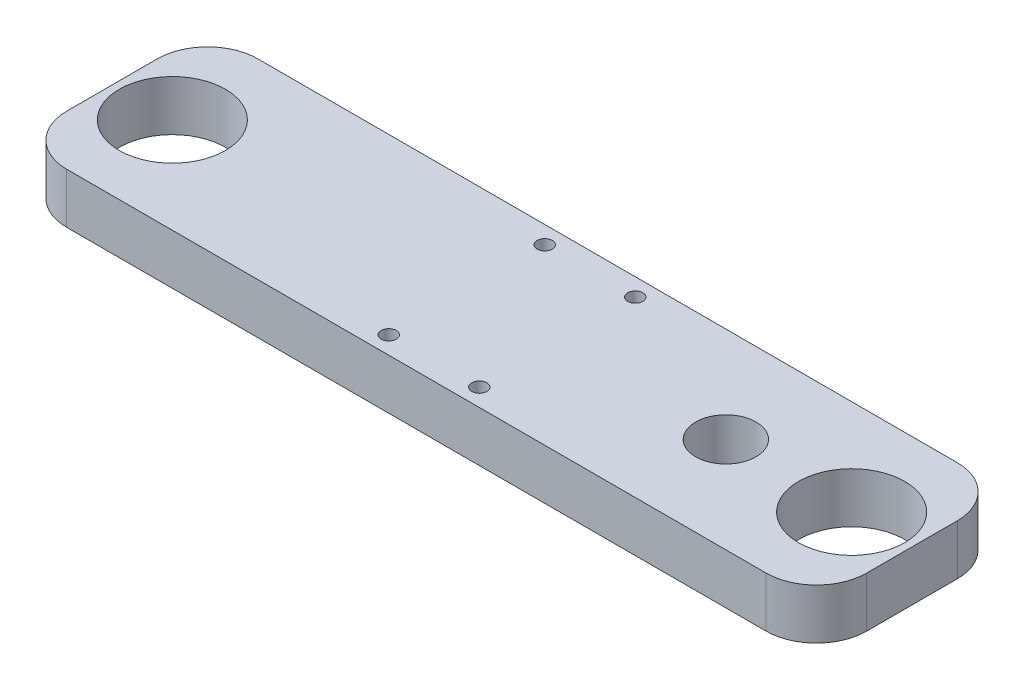
ISO-10303-21;
HEADER;
FILE_DESCRIPTION(('STEP AP214'),'2;1');
FILE_NAME('part.step','',(''),(''),'','','');
FILE_SCHEMA(('AUTOMOTIVE_DESIGN { 1 0 10303 214 1 1 1 1 }'));
ENDSEC;
DATA;
#1=APPLICATION_CONTEXT('core data for automotive mechanical design processes');
#2=APPLICATION_PROTOCOL_DEFINITION('international standard','automotive_design',2000,#1);
#3=PRODUCT_CONTEXT('',#1,'mechanical');
#4=PRODUCT('Part','Part','',(#3));
#5=PRODUCT_RELATED_PRODUCT_CATEGORY('part','',(#4));
#6=PRODUCT_DEFINITION_FORMATION('','',#4);
#7=PRODUCT_DEFINITION_CONTEXT('part definition',#1,'design');
#8=PRODUCT_DEFINITION('design','',#6,#7);
#9=PRODUCT_DEFINITION_SHAPE('','',#8);
#10=(LENGTH_UNIT() NAMED_UNIT(*) SI_UNIT(.MILLI.,.METRE.));
#11=(NAMED_UNIT(*) PLANE_ANGLE_UNIT() SI_UNIT($,.RADIAN.));
#12=(NAMED_UNIT(*) SI_UNIT($,.STERADIAN.) SOLID_ANGLE_UNIT());
#13=UNCERTAINTY_MEASURE_WITH_UNIT(LENGTH_MEASURE(1.E-05),#10,'distance_accuracy_value','');
#14=(GEOMETRIC_REPRESENTATION_CONTEXT(3) GLOBAL_UNCERTAINTY_ASSIGNED_CONTEXT((#13)) GLOBAL_UNIT_ASSIGNED_CONTEXT((#10,
#11,#12)) REPRESENTATION_CONTEXT('',''));
#15=CARTESIAN_POINT('',(0.,0.,0.));
#16=DIRECTION('',(0.,0.,1.));
#17=DIRECTION('',(1.,0.,0.));
#18=AXIS2_PLACEMENT_3D('',#15,#16,#17);
#19=CARTESIAN_POINT('',(0.,10.,0.));
#20=DIRECTION('',(0.,-1.,0.));
#21=DIRECTION('',(0.,0.,-1.));
#22=AXIS2_PLACEMENT_3D('',#19,#20,#21);
#23=PLANE('',#22);
#24=DIRECTION('',(1.,0.,0.));
#25=VECTOR('',#24,1.);
#26=CARTESIAN_POINT('',(-79.5,10.,19.));
#27=LINE('',#26,#25);
#28=CARTESIAN_POINT('',(-69.5,10.,19.));
#29=VERTEX_POINT('',#28);
#30=CARTESIAN_POINT('',(69.5,10.,19.));
#31=VERTEX_POINT('',#30);
#32=EDGE_CURVE('E139',#29,#31,#27,.T.);
#33=ORIENTED_EDGE('',*,*,#32,.T.);
#34=CARTESIAN_POINT('',(69.5,10.,9.));
#35=DIRECTION('',(0.,-1.,0.));
#36=DIRECTION('',(0.,0.,-1.));
#37=AXIS2_PLACEMENT_3D('',#34,#35,#36);
#38=CIRCLE('',#37,10.);
#39=CARTESIAN_POINT('',(79.5,10.,9.));
#40=VERTEX_POINT('',#39);
#41=EDGE_CURVE('E158',#31,#40,#38,.F.);
#42=ORIENTED_EDGE('',*,*,#41,.T.);
#43=DIRECTION('',(0.,0.,-1.));
#44=VECTOR('',#43,1.);
#45=CARTESIAN_POINT('',(79.5,10.,19.));
#46=LINE('',#45,#44);
#47=CARTESIAN_POINT('',(79.5,10.,-9.));
#48=VERTEX_POINT('',#47);
#49=EDGE_CURVE('E122',#40,#48,#46,.T.);
#50=ORIENTED_EDGE('',*,*,#49,.T.);
#51=CARTESIAN_POINT('',(69.5,10.,-9.));
#52=DIRECTION('',(0.,-1.,0.));
#53=DIRECTION('',(0.,0.,-1.));
#54=AXIS2_PLACEMENT_3D('',#51,#52,#53);
#55=CIRCLE('',#54,10.);
#56=CARTESIAN_POINT('',(69.5,10.,-19.));
#57=VERTEX_POINT('',#56);
#58=EDGE_CURVE('E156',#48,#57,#55,.F.);
#59=ORIENTED_EDGE('',*,*,#58,.T.);
#60=DIRECTION('',(-1.,0.,0.));
#61=VECTOR('',#60,1.);
#62=CARTESIAN_POINT('',(-79.5,10.,-19.));
#63=LINE('',#62,#61);
#64=CARTESIAN_POINT('',(-69.5,10.,-19.));
#65=VERTEX_POINT('',#64);
#66=EDGE_CURVE('E169',#57,#65,#63,.T.);
#67=ORIENTED_EDGE('',*,*,#66,.T.);
#68=CARTESIAN_POINT('',(-69.5,10.,-9.));
#69=DIRECTION('',(0.,-1.,0.));
#70=DIRECTION('',(0.,0.,-1.));
#71=AXIS2_PLACEMENT_3D('',#68,#69,#70);
#72=CIRCLE('',#71,10.);
#73=CARTESIAN_POINT('',(-79.5,10.,-9.));
#74=VERTEX_POINT('',#73);
#75=EDGE_CURVE('E57',#65,#74,#72,.F.);
#76=ORIENTED_EDGE('',*,*,#75,.T.);
#77=DIRECTION('',(0.,0.,1.));
#78=VECTOR('',#77,1.);
#79=CARTESIAN_POINT('',(-79.5,10.,19.));
#80=LINE('',#79,#78);
#81=CARTESIAN_POINT('',(-79.5,10.,9.));
#82=VERTEX_POINT('',#81);
#83=EDGE_CURVE('E177',#74,#82,#80,.T.);
#84=ORIENTED_EDGE('',*,*,#83,.T.);
#85=CARTESIAN_POINT('',(-69.5,10.,9.));
#86=DIRECTION('',(0.,-1.,0.));
#87=DIRECTION('',(0.,0.,-1.));
#88=AXIS2_PLACEMENT_3D('',#85,#86,#87);
#89=CIRCLE('',#88,10.);
#90=EDGE_CURVE('E153',#82,#29,#89,.F.);
#91=ORIENTED_EDGE('',*,*,#90,.T.);
#92=EDGE_LOOP('',(#33,#42,#50,#59,#67,#76,#84,#91));
#93=FACE_BOUND('',#92,.T.);
#94=CARTESIAN_POINT('',(9.,10.,-15.5));
#95=DIRECTION('',(0.,1.,0.));
#96=DIRECTION('',(0.,0.,1.));
#97=AXIS2_PLACEMENT_3D('',#94,#95,#96);
#98=CIRCLE('',#97,1.5);
#99=CARTESIAN_POINT('',(9.,10.,-14.));
#100=VERTEX_POINT('',#99);
#101=EDGE_CURVE('E130',#100,#100,#98,.T.);
#102=ORIENTED_EDGE('',*,*,#101,.F.);
#103=EDGE_LOOP('',(#102));
#104=FACE_BOUND('',#103,.T.);
#105=CARTESIAN_POINT('',(-8.99999999999999,10.,-15.5));
#106=DIRECTION('',(0.,1.,0.));
#107=DIRECTION('',(0.,0.,1.));
#108=AXIS2_PLACEMENT_3D('',#105,#106,#107);
#109=CIRCLE('',#108,1.5);
#110=CARTESIAN_POINT('',(-8.99999999999999,10.,-14.));
#111=VERTEX_POINT('',#110);
#112=EDGE_CURVE('E184',#111,#111,#109,.T.);
#113=ORIENTED_EDGE('',*,*,#112,.F.);
#114=EDGE_LOOP('',(#113));
#115=FACE_BOUND('',#114,.T.);
#116=CARTESIAN_POINT('',(-8.99999999999999,10.,15.5));
#117=DIRECTION('',(0.,1.,0.));
#118=DIRECTION('',(0.,0.,1.));
#119=AXIS2_PLACEMENT_3D('',#116,#117,#118);
#120=CIRCLE('',#119,1.5);
#121=CARTESIAN_POINT('',(-8.99999999999999,10.,17.));
#122=VERTEX_POINT('',#121);
#123=EDGE_CURVE('E189',#122,#122,#120,.T.);
#124=ORIENTED_EDGE('',*,*,#123,.F.);
#125=EDGE_LOOP('',(#124));
#126=FACE_BOUND('',#125,.T.);
#127=CARTESIAN_POINT('',(9.,10.,15.5));
#128=DIRECTION('',(0.,1.,0.));
#129=DIRECTION('',(0.,0.,1.));
#130=AXIS2_PLACEMENT_3D('',#127,#128,#129);
#131=CIRCLE('',#130,1.5);
#132=CARTESIAN_POINT('',(9.,10.,17.));
#133=VERTEX_POINT('',#132);
#134=EDGE_CURVE('E195',#133,#133,#131,.T.);
#135=ORIENTED_EDGE('',*,*,#134,.F.);
#136=EDGE_LOOP('',(#135));
#137=FACE_BOUND('',#136,.T.);
#138=CARTESIAN_POINT('',(-67.5,10.,0.));
#139=DIRECTION('',(0.,1.,0.));
#140=DIRECTION('',(0.,0.,1.));
#141=AXIS2_PLACEMENT_3D('',#138,#139,#140);
#142=CIRCLE('',#141,10.55);
#143=CARTESIAN_POINT('',(-67.5,10.,10.55));
#144=VERTEX_POINT('',#143);
#145=EDGE_CURVE('E201',#144,#144,#142,.T.);
#146=ORIENTED_EDGE('',*,*,#145,.F.);
#147=EDGE_LOOP('',(#146));
#148=FACE_BOUND('',#147,.T.);
#149=CARTESIAN_POINT('',(67.5,10.,0.));
#150=DIRECTION('',(0.,1.,0.));
#151=DIRECTION('',(0.,0.,1.));
#152=AXIS2_PLACEMENT_3D('',#149,#150,#151);
#153=CIRCLE('',#152,10.55);
#154=CARTESIAN_POINT('',(67.5,10.,10.55));
#155=VERTEX_POINT('',#154);
#156=EDGE_CURVE('E207',#155,#155,#153,.T.);
#157=ORIENTED_EDGE('',*,*,#156,.F.);
#158=EDGE_LOOP('',(#157));
#159=FACE_BOUND('',#158,.T.);
#160=CARTESIAN_POINT('',(42.5,10.,0.));
#161=DIRECTION('',(0.,1.,0.));
#162=DIRECTION('',(0.,0.,1.));
#163=AXIS2_PLACEMENT_3D('',#160,#161,#162);
#164=CIRCLE('',#163,5.99999999999999);
#165=CARTESIAN_POINT('',(42.5,10.,5.99999999999999));
#166=VERTEX_POINT('',#165);
#167=EDGE_CURVE('E213',#166,#166,#164,.T.);
#168=ORIENTED_EDGE('',*,*,#167,.F.);
#169=EDGE_LOOP('',(#168));
#170=FACE_BOUND('',#169,.T.);
#171=ADVANCED_FACE('F36',(#93,#104,#115,#126,#137,#148,#159,#170),#23,.F.);
#172=CARTESIAN_POINT('',(0.,0.,0.));
#173=DIRECTION('',(0.,-1.,0.));
#174=DIRECTION('',(0.,0.,-1.));
#175=AXIS2_PLACEMENT_3D('',#172,#173,#174);
#176=PLANE('',#175);
#177=CARTESIAN_POINT('',(67.5,0.,0.));
#178=DIRECTION('',(0.,1.,0.));
#179=DIRECTION('',(0.,0.,1.));
#180=AXIS2_PLACEMENT_3D('',#177,#178,#179);
#181=CIRCLE('',#180,10.55);
#182=CARTESIAN_POINT('',(67.5,0.,10.55));
#183=VERTEX_POINT('',#182);
#184=EDGE_CURVE('E210',#183,#183,#181,.T.);
#185=ORIENTED_EDGE('',*,*,#184,.T.);
#186=EDGE_LOOP('',(#185));
#187=FACE_BOUND('',#186,.T.);
#188=CARTESIAN_POINT('',(9.,0.,15.5));
#189=DIRECTION('',(0.,1.,0.));
#190=DIRECTION('',(0.,0.,1.));
#191=AXIS2_PLACEMENT_3D('',#188,#189,#190);
#192=CIRCLE('',#191,1.5);
#193=CARTESIAN_POINT('',(9.,0.,17.));
#194=VERTEX_POINT('',#193);
#195=EDGE_CURVE('E198',#194,#194,#192,.T.);
#196=ORIENTED_EDGE('',*,*,#195,.T.);
#197=EDGE_LOOP('',(#196));
#198=FACE_BOUND('',#197,.T.);
#199=CARTESIAN_POINT('',(-8.99999999999999,0.,-15.5));
#200=DIRECTION('',(0.,1.,0.));
#201=DIRECTION('',(0.,0.,1.));
#202=AXIS2_PLACEMENT_3D('',#199,#200,#201);
#203=CIRCLE('',#202,1.5);
#204=CARTESIAN_POINT('',(-8.99999999999999,0.,-14.));
#205=VERTEX_POINT('',#204);
#206=EDGE_CURVE('E186',#205,#205,#203,.T.);
#207=ORIENTED_EDGE('',*,*,#206,.T.);
#208=EDGE_LOOP('',(#207));
#209=FACE_BOUND('',#208,.T.);
#210=DIRECTION('',(0.,0.,-1.));
#211=VECTOR('',#210,1.);
#212=CARTESIAN_POINT('',(79.5,0.,19.));
#213=LINE('',#212,#211);
#214=CARTESIAN_POINT('',(79.5,0.,9.));
#215=VERTEX_POINT('',#214);
#216=CARTESIAN_POINT('',(79.5,0.,-9.));
#217=VERTEX_POINT('',#216);
#218=EDGE_CURVE('E119',#215,#217,#213,.T.);
#219=ORIENTED_EDGE('',*,*,#218,.F.);
#220=CARTESIAN_POINT('',(69.5,0.,9.));
#221=DIRECTION('',(0.,-1.,0.));
#222=DIRECTION('',(0.,0.,-1.));
#223=AXIS2_PLACEMENT_3D('',#220,#221,#222);
#224=CIRCLE('',#223,10.);
#225=CARTESIAN_POINT('',(69.5,0.,19.));
#226=VERTEX_POINT('',#225);
#227=EDGE_CURVE('E102',#215,#226,#224,.T.);
#228=ORIENTED_EDGE('',*,*,#227,.T.);
#229=DIRECTION('',(1.,0.,0.));
#230=VECTOR('',#229,1.);
#231=CARTESIAN_POINT('',(-79.5,0.,19.));
#232=LINE('',#231,#230);
#233=CARTESIAN_POINT('',(-69.5,0.,19.));
#234=VERTEX_POINT('',#233);
#235=EDGE_CURVE('E143',#234,#226,#232,.T.);
#236=ORIENTED_EDGE('',*,*,#235,.F.);
#237=CARTESIAN_POINT('',(-69.5,0.,9.));
#238=DIRECTION('',(0.,-1.,0.));
#239=DIRECTION('',(0.,0.,-1.));
#240=AXIS2_PLACEMENT_3D('',#237,#238,#239);
#241=CIRCLE('',#240,10.);
#242=CARTESIAN_POINT('',(-79.5,0.,9.));
#243=VERTEX_POINT('',#242);
#244=EDGE_CURVE('E123',#234,#243,#241,.T.);
#245=ORIENTED_EDGE('',*,*,#244,.T.);
#246=DIRECTION('',(0.,0.,1.));
#247=VECTOR('',#246,1.);
#248=CARTESIAN_POINT('',(-79.5,0.,19.));
#249=LINE('',#248,#247);
#250=CARTESIAN_POINT('',(-79.5,0.,-9.));
#251=VERTEX_POINT('',#250);
#252=EDGE_CURVE('E133',#251,#243,#249,.T.);
#253=ORIENTED_EDGE('',*,*,#252,.F.);
#254=CARTESIAN_POINT('',(-69.5,0.,-9.));
#255=DIRECTION('',(0.,-1.,0.));
#256=DIRECTION('',(0.,0.,-1.));
#257=AXIS2_PLACEMENT_3D('',#254,#255,#256);
#258=CIRCLE('',#257,10.);
#259=CARTESIAN_POINT('',(-69.5,0.,-19.));
#260=VERTEX_POINT('',#259);
#261=EDGE_CURVE('E147',#251,#260,#258,.T.);
#262=ORIENTED_EDGE('',*,*,#261,.T.);
#263=DIRECTION('',(-1.,0.,0.));
#264=VECTOR('',#263,1.);
#265=CARTESIAN_POINT('',(-79.5,0.,-19.));
#266=LINE('',#265,#264);
#267=CARTESIAN_POINT('',(69.5,0.,-19.));
#268=VERTEX_POINT('',#267);
#269=EDGE_CURVE('E129',#268,#260,#266,.T.);
#270=ORIENTED_EDGE('',*,*,#269,.F.);
#271=CARTESIAN_POINT('',(69.5,0.,-9.));
#272=DIRECTION('',(0.,-1.,0.));
#273=DIRECTION('',(0.,0.,-1.));
#274=AXIS2_PLACEMENT_3D('',#271,#272,#273);
#275=CIRCLE('',#274,10.);
#276=EDGE_CURVE('E113',#268,#217,#275,.T.);
#277=ORIENTED_EDGE('',*,*,#276,.T.);
#278=EDGE_LOOP('',(#219,#228,#236,#245,#253,#262,#270,#277));
#279=FACE_BOUND('',#278,.T.);
#280=CARTESIAN_POINT('',(9.,0.,-15.5));
#281=DIRECTION('',(0.,1.,0.));
#282=DIRECTION('',(0.,0.,1.));
#283=AXIS2_PLACEMENT_3D('',#280,#281,#282);
#284=CIRCLE('',#283,1.5);
#285=CARTESIAN_POINT('',(9.,0.,-14.));
#286=VERTEX_POINT('',#285);
#287=EDGE_CURVE('E136',#286,#286,#284,.T.);
#288=ORIENTED_EDGE('',*,*,#287,.T.);
#289=EDGE_LOOP('',(#288));
#290=FACE_BOUND('',#289,.T.);
#291=CARTESIAN_POINT('',(-8.99999999999999,0.,15.5));
#292=DIRECTION('',(0.,1.,0.));
#293=DIRECTION('',(0.,0.,1.));
#294=AXIS2_PLACEMENT_3D('',#291,#292,#293);
#295=CIRCLE('',#294,1.5);
#296=CARTESIAN_POINT('',(-8.99999999999999,0.,17.));
#297=VERTEX_POINT('',#296);
#298=EDGE_CURVE('E192',#297,#297,#295,.T.);
#299=ORIENTED_EDGE('',*,*,#298,.T.);
#300=EDGE_LOOP('',(#299));
#301=FACE_BOUND('',#300,.T.);
#302=CARTESIAN_POINT('',(-67.5,0.,0.));
#303=DIRECTION('',(0.,1.,0.));
#304=DIRECTION('',(0.,0.,1.));
#305=AXIS2_PLACEMENT_3D('',#302,#303,#304);
#306=CIRCLE('',#305,10.55);
#307=CARTESIAN_POINT('',(-67.5,0.,10.55));
#308=VERTEX_POINT('',#307);
#309=EDGE_CURVE('E204',#308,#308,#306,.T.);
#310=ORIENTED_EDGE('',*,*,#309,.T.);
#311=EDGE_LOOP('',(#310));
#312=FACE_BOUND('',#311,.T.);
#313=CARTESIAN_POINT('',(42.5,0.,0.));
#314=DIRECTION('',(0.,1.,0.));
#315=DIRECTION('',(0.,0.,1.));
#316=AXIS2_PLACEMENT_3D('',#313,#314,#315);
#317=CIRCLE('',#316,5.99999999999999);
#318=CARTESIAN_POINT('',(42.5,0.,5.99999999999999));
#319=VERTEX_POINT('',#318);
#320=EDGE_CURVE('E216',#319,#319,#317,.T.);
#321=ORIENTED_EDGE('',*,*,#320,.T.);
#322=EDGE_LOOP('',(#321));
#323=FACE_BOUND('',#322,.T.);
#324=ADVANCED_FACE('F126',(#187,#198,#209,#279,#290,#301,#312,#323),#176,.T.);
#325=CARTESIAN_POINT('',(79.5,10.,19.));
#326=DIRECTION('',(-1.,0.,0.));
#327=DIRECTION('',(0.,0.,1.));
#328=AXIS2_PLACEMENT_3D('',#325,#326,#327);
#329=PLANE('',#328);
#330=ORIENTED_EDGE('',*,*,#49,.F.);
#331=DIRECTION('',(0.,-1.,0.));
#332=VECTOR('',#331,1.);
#333=CARTESIAN_POINT('',(79.5,10.,9.));
#334=LINE('',#333,#332);
#335=EDGE_CURVE('E106',#40,#215,#334,.T.);
#336=ORIENTED_EDGE('',*,*,#335,.T.);
#337=ORIENTED_EDGE('',*,*,#218,.T.);
#338=DIRECTION('',(0.,-1.,0.));
#339=VECTOR('',#338,1.);
#340=CARTESIAN_POINT('',(79.5,10.,-9.));
#341=LINE('',#340,#339);
#342=EDGE_CURVE('E124',#217,#48,#341,.F.);
#343=ORIENTED_EDGE('',*,*,#342,.T.);
#344=EDGE_LOOP('',(#330,#336,#337,#343));
#345=FACE_BOUND('',#344,.T.);
#346=ADVANCED_FACE('F118',(#345),#329,.F.);
#347=CARTESIAN_POINT('',(-79.5,10.,-19.));
#348=DIRECTION('',(0.,0.,1.));
#349=DIRECTION('',(1.,0.,0.));
#350=AXIS2_PLACEMENT_3D('',#347,#348,#349);
#351=PLANE('',#350);
#352=ORIENTED_EDGE('',*,*,#66,.F.);
#353=DIRECTION('',(0.,-1.,0.));
#354=VECTOR('',#353,1.);
#355=CARTESIAN_POINT('',(69.5,10.,-19.));
#356=LINE('',#355,#354);
#357=EDGE_CURVE('E162',#57,#268,#356,.T.);
#358=ORIENTED_EDGE('',*,*,#357,.T.);
#359=ORIENTED_EDGE('',*,*,#269,.T.);
#360=DIRECTION('',(0.,-1.,0.));
#361=VECTOR('',#360,1.);
#362=CARTESIAN_POINT('',(-69.5,10.,-19.));
#363=LINE('',#362,#361);
#364=EDGE_CURVE('E160',#260,#65,#363,.F.);
#365=ORIENTED_EDGE('',*,*,#364,.T.);
#366=EDGE_LOOP('',(#352,#358,#359,#365));
#367=FACE_BOUND('',#366,.T.);
#368=ADVANCED_FACE('F167',(#367),#351,.F.);
#369=CARTESIAN_POINT('',(-79.5,10.,19.));
#370=DIRECTION('',(1.,0.,0.));
#371=DIRECTION('',(0.,0.,-1.));
#372=AXIS2_PLACEMENT_3D('',#369,#370,#371);
#373=PLANE('',#372);
#374=ORIENTED_EDGE('',*,*,#83,.F.);
#375=DIRECTION('',(0.,-1.,0.));
#376=VECTOR('',#375,1.);
#377=CARTESIAN_POINT('',(-79.5,10.,-9.));
#378=LINE('',#377,#376);
#379=EDGE_CURVE('E11',#74,#251,#378,.T.);
#380=ORIENTED_EDGE('',*,*,#379,.T.);
#381=ORIENTED_EDGE('',*,*,#252,.T.);
#382=DIRECTION('',(0.,-1.,0.));
#383=VECTOR('',#382,1.);
#384=CARTESIAN_POINT('',(-79.5,10.,9.));
#385=LINE('',#384,#383);
#386=EDGE_CURVE('E44',#243,#82,#385,.F.);
#387=ORIENTED_EDGE('',*,*,#386,.T.);
#388=EDGE_LOOP('',(#374,#380,#381,#387));
#389=FACE_BOUND('',#388,.T.);
#390=ADVANCED_FACE('F176',(#389),#373,.F.);
#391=CARTESIAN_POINT('',(-79.5,10.,19.));
#392=DIRECTION('',(0.,0.,-1.));
#393=DIRECTION('',(-1.,0.,0.));
#394=AXIS2_PLACEMENT_3D('',#391,#392,#393);
#395=PLANE('',#394);
#396=ORIENTED_EDGE('',*,*,#235,.T.);
#397=DIRECTION('',(0.,-1.,0.));
#398=VECTOR('',#397,1.);
#399=CARTESIAN_POINT('',(69.5,10.,19.));
#400=LINE('',#399,#398);
#401=EDGE_CURVE('E107',#226,#31,#400,.F.);
#402=ORIENTED_EDGE('',*,*,#401,.T.);
#403=ORIENTED_EDGE('',*,*,#32,.F.);
#404=DIRECTION('',(0.,-1.,0.));
#405=VECTOR('',#404,1.);
#406=CARTESIAN_POINT('',(-69.5,10.,19.));
#407=LINE('',#406,#405);
#408=EDGE_CURVE('E112',#29,#234,#407,.T.);
#409=ORIENTED_EDGE('',*,*,#408,.T.);
#410=EDGE_LOOP('',(#396,#402,#403,#409));
#411=FACE_BOUND('',#410,.T.);
#412=ADVANCED_FACE('F237',(#411),#395,.F.);
#413=CARTESIAN_POINT('',(9.,10.,-15.5));
#414=DIRECTION('',(0.,-1.,0.));
#415=DIRECTION('',(0.,0.,-1.));
#416=AXIS2_PLACEMENT_3D('',#413,#414,#415);
#417=CYLINDRICAL_SURFACE('',#416,1.5);
#418=ORIENTED_EDGE('',*,*,#101,.T.);
#419=EDGE_LOOP('',(#418));
#420=FACE_BOUND('',#419,.T.);
#421=ORIENTED_EDGE('',*,*,#287,.F.);
#422=EDGE_LOOP('',(#421));
#423=FACE_BOUND('',#422,.T.);
#424=ADVANCED_FACE('F234',(#420,#423),#417,.F.);
#425=CARTESIAN_POINT('',(-8.99999999999999,10.,-15.5));
#426=DIRECTION('',(0.,-1.,0.));
#427=DIRECTION('',(0.,0.,-1.));
#428=AXIS2_PLACEMENT_3D('',#425,#426,#427);
#429=CYLINDRICAL_SURFACE('',#428,1.5);
#430=ORIENTED_EDGE('',*,*,#112,.T.);
#431=EDGE_LOOP('',(#430));
#432=FACE_BOUND('',#431,.T.);
#433=ORIENTED_EDGE('',*,*,#206,.F.);
#434=EDGE_LOOP('',(#433));
#435=FACE_BOUND('',#434,.T.);
#436=ADVANCED_FACE('F360',(#432,#435),#429,.F.);
#437=CARTESIAN_POINT('',(-8.99999999999999,10.,15.5));
#438=DIRECTION('',(0.,-1.,0.));
#439=DIRECTION('',(0.,0.,-1.));
#440=AXIS2_PLACEMENT_3D('',#437,#438,#439);
#441=CYLINDRICAL_SURFACE('',#440,1.5);
#442=ORIENTED_EDGE('',*,*,#123,.T.);
#443=EDGE_LOOP('',(#442));
#444=FACE_BOUND('',#443,.T.);
#445=ORIENTED_EDGE('',*,*,#298,.F.);
#446=EDGE_LOOP('',(#445));
#447=FACE_BOUND('',#446,.T.);
#448=ADVANCED_FACE('F350',(#444,#447),#441,.F.);
#449=CARTESIAN_POINT('',(9.,10.,15.5));
#450=DIRECTION('',(0.,-1.,0.));
#451=DIRECTION('',(0.,0.,-1.));
#452=AXIS2_PLACEMENT_3D('',#449,#450,#451);
#453=CYLINDRICAL_SURFACE('',#452,1.5);
#454=ORIENTED_EDGE('',*,*,#134,.T.);
#455=EDGE_LOOP('',(#454));
#456=FACE_BOUND('',#455,.T.);
#457=ORIENTED_EDGE('',*,*,#195,.F.);
#458=EDGE_LOOP('',(#457));
#459=FACE_BOUND('',#458,.T.);
#460=ADVANCED_FACE('F340',(#456,#459),#453,.F.);
#461=CARTESIAN_POINT('',(-67.5,10.,0.));
#462=DIRECTION('',(0.,-1.,0.));
#463=DIRECTION('',(0.,0.,-1.));
#464=AXIS2_PLACEMENT_3D('',#461,#462,#463);
#465=CYLINDRICAL_SURFACE('',#464,10.55);
#466=ORIENTED_EDGE('',*,*,#145,.T.);
#467=EDGE_LOOP('',(#466));
#468=FACE_BOUND('',#467,.T.);
#469=ORIENTED_EDGE('',*,*,#309,.F.);
#470=EDGE_LOOP('',(#469));
#471=FACE_BOUND('',#470,.T.);
#472=ADVANCED_FACE('F330',(#468,#471),#465,.F.);
#473=CARTESIAN_POINT('',(67.5,10.,0.));
#474=DIRECTION('',(0.,-1.,0.));
#475=DIRECTION('',(0.,0.,-1.));
#476=AXIS2_PLACEMENT_3D('',#473,#474,#475);
#477=CYLINDRICAL_SURFACE('',#476,10.55);
#478=ORIENTED_EDGE('',*,*,#156,.T.);
#479=EDGE_LOOP('',(#478));
#480=FACE_BOUND('',#479,.T.);
#481=ORIENTED_EDGE('',*,*,#184,.F.);
#482=EDGE_LOOP('',(#481));
#483=FACE_BOUND('',#482,.T.);
#484=ADVANCED_FACE('F321',(#480,#483),#477,.F.);
#485=CARTESIAN_POINT('',(42.5,10.,0.));
#486=DIRECTION('',(0.,-1.,0.));
#487=DIRECTION('',(0.,0.,-1.));
#488=AXIS2_PLACEMENT_3D('',#485,#486,#487);
#489=CYLINDRICAL_SURFACE('',#488,5.99999999999999);
#490=ORIENTED_EDGE('',*,*,#167,.T.);
#491=EDGE_LOOP('',(#490));
#492=FACE_BOUND('',#491,.T.);
#493=ORIENTED_EDGE('',*,*,#320,.F.);
#494=EDGE_LOOP('',(#493));
#495=FACE_BOUND('',#494,.T.);
#496=ADVANCED_FACE('F222',(#492,#495),#489,.F.);
#497=CARTESIAN_POINT('',(69.5,10.,9.));
#498=DIRECTION('',(0.,-1.,0.));
#499=DIRECTION('',(0.,0.,-1.));
#500=AXIS2_PLACEMENT_3D('',#497,#498,#499);
#501=CYLINDRICAL_SURFACE('',#500,10.);
#502=ORIENTED_EDGE('',*,*,#41,.F.);
#503=ORIENTED_EDGE('',*,*,#401,.F.);
#504=ORIENTED_EDGE('',*,*,#227,.F.);
#505=ORIENTED_EDGE('',*,*,#335,.F.);
#506=EDGE_LOOP('',(#502,#503,#504,#505));
#507=FACE_BOUND('',#506,.T.);
#508=ADVANCED_FACE('F105',(#507),#501,.T.);
#509=CARTESIAN_POINT('',(69.5,10.,-9.));
#510=DIRECTION('',(0.,-1.,0.));
#511=DIRECTION('',(0.,0.,-1.));
#512=AXIS2_PLACEMENT_3D('',#509,#510,#511);
#513=CYLINDRICAL_SURFACE('',#512,10.);
#514=ORIENTED_EDGE('',*,*,#58,.F.);
#515=ORIENTED_EDGE('',*,*,#342,.F.);
#516=ORIENTED_EDGE('',*,*,#276,.F.);
#517=ORIENTED_EDGE('',*,*,#357,.F.);
#518=EDGE_LOOP('',(#514,#515,#516,#517));
#519=FACE_BOUND('',#518,.T.);
#520=ADVANCED_FACE('F249',(#519),#513,.T.);
#521=CARTESIAN_POINT('',(-69.5,10.,-9.));
#522=DIRECTION('',(0.,-1.,0.));
#523=DIRECTION('',(0.,0.,-1.));
#524=AXIS2_PLACEMENT_3D('',#521,#522,#523);
#525=CYLINDRICAL_SURFACE('',#524,10.);
#526=ORIENTED_EDGE('',*,*,#75,.F.);
#527=ORIENTED_EDGE('',*,*,#364,.F.);
#528=ORIENTED_EDGE('',*,*,#261,.F.);
#529=ORIENTED_EDGE('',*,*,#379,.F.);
#530=EDGE_LOOP('',(#526,#527,#528,#529));
#531=FACE_BOUND('',#530,.T.);
#532=ADVANCED_FACE('F175',(#531),#525,.T.);
#533=CARTESIAN_POINT('',(-69.5,10.,9.));
#534=DIRECTION('',(0.,-1.,0.));
#535=DIRECTION('',(0.,0.,-1.));
#536=AXIS2_PLACEMENT_3D('',#533,#534,#535);
#537=CYLINDRICAL_SURFACE('',#536,10.);
#538=ORIENTED_EDGE('',*,*,#90,.F.);
#539=ORIENTED_EDGE('',*,*,#386,.F.);
#540=ORIENTED_EDGE('',*,*,#244,.F.);
#541=ORIENTED_EDGE('',*,*,#408,.F.);
#542=EDGE_LOOP('',(#538,#539,#540,#541));
#543=FACE_BOUND('',#542,.T.);
#544=ADVANCED_FACE('F38',(#543),#537,.T.);
#545=CLOSED_SHELL('',(#171,#324,#346,#368,#390,#412,#424,#436,#448,#460,#472,#484,#496,#508,
#520,#532,#544));
#546=MANIFOLD_SOLID_BREP('B2',#545);
#547=ADVANCED_BREP_SHAPE_REPRESENTATION('',(#18,#546),#14);
#548=SHAPE_DEFINITION_REPRESENTATION(#9,#547);
ENDSEC;
END-ISO-10303-21;
